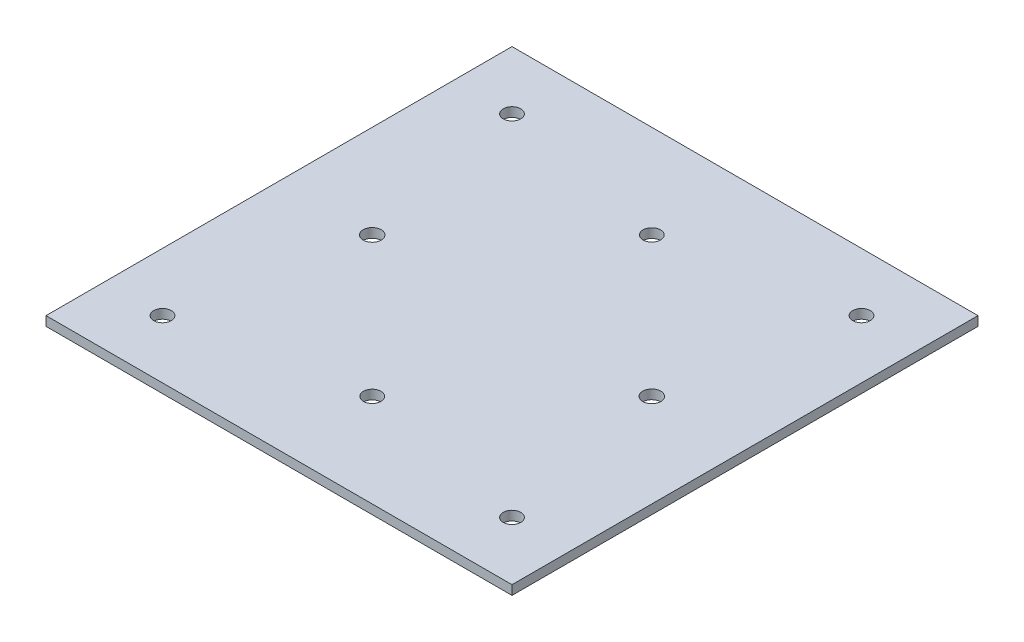
ISO-10303-21;
HEADER;
FILE_DESCRIPTION(('STEP AP214'),'2;1');
FILE_NAME('part.step','',(''),(''),'','','');
FILE_SCHEMA(('AUTOMOTIVE_DESIGN { 1 0 10303 214 1 1 1 1 }'));
ENDSEC;
DATA;
#1=APPLICATION_CONTEXT('core data for automotive mechanical design processes');
#2=APPLICATION_PROTOCOL_DEFINITION('international standard','automotive_design',2000,#1);
#3=PRODUCT_CONTEXT('',#1,'mechanical');
#4=PRODUCT('Part','Part','',(#3));
#5=PRODUCT_RELATED_PRODUCT_CATEGORY('part','',(#4));
#6=PRODUCT_DEFINITION_FORMATION('','',#4);
#7=PRODUCT_DEFINITION_CONTEXT('part definition',#1,'design');
#8=PRODUCT_DEFINITION('design','',#6,#7);
#9=PRODUCT_DEFINITION_SHAPE('','',#8);
#10=(LENGTH_UNIT() NAMED_UNIT(*) SI_UNIT(.MILLI.,.METRE.));
#11=(NAMED_UNIT(*) PLANE_ANGLE_UNIT() SI_UNIT($,.RADIAN.));
#12=(NAMED_UNIT(*) SI_UNIT($,.STERADIAN.) SOLID_ANGLE_UNIT());
#13=UNCERTAINTY_MEASURE_WITH_UNIT(LENGTH_MEASURE(1.E-05),#10,'distance_accuracy_value','');
#14=(GEOMETRIC_REPRESENTATION_CONTEXT(3) GLOBAL_UNCERTAINTY_ASSIGNED_CONTEXT((#13)) GLOBAL_UNIT_ASSIGNED_CONTEXT((#10,
#11,#12)) REPRESENTATION_CONTEXT('',''));
#15=CARTESIAN_POINT('',(0.,0.,0.));
#16=DIRECTION('',(0.,0.,1.));
#17=DIRECTION('',(1.,0.,0.));
#18=AXIS2_PLACEMENT_3D('',#15,#16,#17);
#19=CARTESIAN_POINT('',(0.,1.6,0.));
#20=DIRECTION('',(0.,-1.,0.));
#21=DIRECTION('',(0.,0.,-1.));
#22=AXIS2_PLACEMENT_3D('',#19,#20,#21);
#23=PLANE('',#22);
#24=CARTESIAN_POINT('',(24.,1.6,-48.));
#25=DIRECTION('',(0.,1.,0.));
#26=DIRECTION('',(0.,0.,1.));
#27=AXIS2_PLACEMENT_3D('',#24,#25,#26);
#28=CIRCLE('',#27,1.55);
#29=CARTESIAN_POINT('',(24.,1.6,-46.45));
#30=VERTEX_POINT('',#29);
#31=EDGE_CURVE('E142',#30,#30,#28,.T.);
#32=ORIENTED_EDGE('',*,*,#31,.F.);
#33=EDGE_LOOP('',(#32));
#34=FACE_BOUND('',#33,.T.);
#35=CARTESIAN_POINT('',(18.,1.6,-18.));
#36=DIRECTION('',(0.,1.,0.));
#37=DIRECTION('',(0.,0.,-1.));
#38=AXIS2_PLACEMENT_3D('',#35,#36,#37);
#39=CIRCLE('',#38,1.50499999999999);
#40=CARTESIAN_POINT('',(18.,1.6,-19.505));
#41=VERTEX_POINT('',#40);
#42=EDGE_CURVE('E105',#41,#41,#39,.T.);
#43=ORIENTED_EDGE('',*,*,#42,.F.);
#44=EDGE_LOOP('',(#43));
#45=FACE_BOUND('',#44,.T.);
#46=CARTESIAN_POINT('',(78.,1.6,-18.));
#47=DIRECTION('',(0.,1.,0.));
#48=DIRECTION('',(0.,0.,1.));
#49=AXIS2_PLACEMENT_3D('',#46,#47,#48);
#50=CIRCLE('',#49,1.50499999999999);
#51=CARTESIAN_POINT('',(78.,1.6,-16.495));
#52=VERTEX_POINT('',#51);
#53=EDGE_CURVE('E119',#52,#52,#50,.T.);
#54=ORIENTED_EDGE('',*,*,#53,.F.);
#55=EDGE_LOOP('',(#54));
#56=FACE_BOUND('',#55,.T.);
#57=CARTESIAN_POINT('',(78.,1.6,-78.));
#58=DIRECTION('',(0.,1.,0.));
#59=DIRECTION('',(0.,0.,-1.));
#60=AXIS2_PLACEMENT_3D('',#57,#58,#59);
#61=CIRCLE('',#60,1.50499999999999);
#62=CARTESIAN_POINT('',(78.,1.6,-79.505));
#63=VERTEX_POINT('',#62);
#64=EDGE_CURVE('E113',#63,#63,#61,.T.);
#65=ORIENTED_EDGE('',*,*,#64,.F.);
#66=EDGE_LOOP('',(#65));
#67=FACE_BOUND('',#66,.T.);
#68=CARTESIAN_POINT('',(72.,1.6,-48.));
#69=DIRECTION('',(0.,1.,0.));
#70=DIRECTION('',(0.,0.,-1.));
#71=AXIS2_PLACEMENT_3D('',#68,#69,#70);
#72=CIRCLE('',#71,1.55000000000001);
#73=CARTESIAN_POINT('',(72.,1.6,-49.55));
#74=VERTEX_POINT('',#73);
#75=EDGE_CURVE('E143',#74,#74,#72,.T.);
#76=ORIENTED_EDGE('',*,*,#75,.F.);
#77=EDGE_LOOP('',(#76));
#78=FACE_BOUND('',#77,.T.);
#79=CARTESIAN_POINT('',(48.,1.6,-72.));
#80=DIRECTION('',(0.,1.,0.));
#81=DIRECTION('',(0.,0.,1.));
#82=AXIS2_PLACEMENT_3D('',#79,#80,#81);
#83=CIRCLE('',#82,1.505);
#84=CARTESIAN_POINT('',(48.,1.6,-70.495));
#85=VERTEX_POINT('',#84);
#86=EDGE_CURVE('E130',#85,#85,#83,.T.);
#87=ORIENTED_EDGE('',*,*,#86,.F.);
#88=EDGE_LOOP('',(#87));
#89=FACE_BOUND('',#88,.T.);
#90=CARTESIAN_POINT('',(48.,1.6,-24.));
#91=DIRECTION('',(0.,1.,0.));
#92=DIRECTION('',(0.,0.,-1.));
#93=AXIS2_PLACEMENT_3D('',#90,#91,#92);
#94=CIRCLE('',#93,1.505);
#95=CARTESIAN_POINT('',(48.,1.6,-25.505));
#96=VERTEX_POINT('',#95);
#97=EDGE_CURVE('E131',#96,#96,#94,.T.);
#98=ORIENTED_EDGE('',*,*,#97,.F.);
#99=EDGE_LOOP('',(#98));
#100=FACE_BOUND('',#99,.T.);
#101=CARTESIAN_POINT('',(18.,1.6,-78.));
#102=DIRECTION('',(0.,1.,0.));
#103=DIRECTION('',(0.,0.,1.));
#104=AXIS2_PLACEMENT_3D('',#101,#102,#103);
#105=CIRCLE('',#104,1.50499999999999);
#106=CARTESIAN_POINT('',(18.,1.6,-76.495));
#107=VERTEX_POINT('',#106);
#108=EDGE_CURVE('E112',#107,#107,#105,.T.);
#109=ORIENTED_EDGE('',*,*,#108,.F.);
#110=EDGE_LOOP('',(#109));
#111=FACE_BOUND('',#110,.T.);
#112=DIRECTION('',(0.,0.,1.));
#113=VECTOR('',#112,1.);
#114=CARTESIAN_POINT('',(8.00000000000001,1.6,-88.));
#115=LINE('',#114,#113);
#116=CARTESIAN_POINT('',(8.00000000000001,1.6,-88.));
#117=VERTEX_POINT('',#116);
#118=CARTESIAN_POINT('',(8.00000000000004,1.6,-7.99999999999999));
#119=VERTEX_POINT('',#118);
#120=EDGE_CURVE('E101',#117,#119,#115,.T.);
#121=ORIENTED_EDGE('',*,*,#120,.T.);
#122=DIRECTION('',(1.,0.,0.));
#123=VECTOR('',#122,1.);
#124=CARTESIAN_POINT('',(8.00000000000004,1.6,-7.99999999999999));
#125=LINE('',#124,#123);
#126=CARTESIAN_POINT('',(88.,1.6,-8.));
#127=VERTEX_POINT('',#126);
#128=EDGE_CURVE('E99',#119,#127,#125,.T.);
#129=ORIENTED_EDGE('',*,*,#128,.T.);
#130=DIRECTION('',(0.,0.,-1.));
#131=VECTOR('',#130,1.);
#132=CARTESIAN_POINT('',(88.,1.6,-88.));
#133=LINE('',#132,#131);
#134=CARTESIAN_POINT('',(88.,1.6,-88.));
#135=VERTEX_POINT('',#134);
#136=EDGE_CURVE('E55',#127,#135,#133,.T.);
#137=ORIENTED_EDGE('',*,*,#136,.T.);
#138=DIRECTION('',(-1.,0.,0.));
#139=VECTOR('',#138,1.);
#140=CARTESIAN_POINT('',(8.00000000000001,1.6,-88.));
#141=LINE('',#140,#139);
#142=EDGE_CURVE('E91',#135,#117,#141,.T.);
#143=ORIENTED_EDGE('',*,*,#142,.T.);
#144=EDGE_LOOP('',(#121,#129,#137,#143));
#145=FACE_BOUND('',#144,.T.);
#146=ADVANCED_FACE('F40',(#34,#45,#56,#67,#78,#89,#100,#111,#145),#23,.F.);
#147=CARTESIAN_POINT('',(0.,0.,0.));
#148=DIRECTION('',(0.,-1.,0.));
#149=DIRECTION('',(0.,0.,-1.));
#150=AXIS2_PLACEMENT_3D('',#147,#148,#149);
#151=PLANE('',#150);
#152=CARTESIAN_POINT('',(24.,0.,-48.));
#153=DIRECTION('',(0.,1.,0.));
#154=DIRECTION('',(0.,0.,1.));
#155=AXIS2_PLACEMENT_3D('',#152,#153,#154);
#156=CIRCLE('',#155,1.55);
#157=CARTESIAN_POINT('',(24.,0.,-46.45));
#158=VERTEX_POINT('',#157);
#159=EDGE_CURVE('E151',#158,#158,#156,.T.);
#160=ORIENTED_EDGE('',*,*,#159,.T.);
#161=EDGE_LOOP('',(#160));
#162=FACE_BOUND('',#161,.T.);
#163=CARTESIAN_POINT('',(18.,0.,-18.));
#164=DIRECTION('',(0.,1.,0.));
#165=DIRECTION('',(0.,0.,-1.));
#166=AXIS2_PLACEMENT_3D('',#163,#164,#165);
#167=CIRCLE('',#166,1.50499999999999);
#168=CARTESIAN_POINT('',(18.,0.,-19.505));
#169=VERTEX_POINT('',#168);
#170=EDGE_CURVE('E122',#169,#169,#167,.T.);
#171=ORIENTED_EDGE('',*,*,#170,.T.);
#172=EDGE_LOOP('',(#171));
#173=FACE_BOUND('',#172,.T.);
#174=CARTESIAN_POINT('',(78.,0.,-18.));
#175=DIRECTION('',(0.,1.,0.));
#176=DIRECTION('',(0.,0.,1.));
#177=AXIS2_PLACEMENT_3D('',#174,#175,#176);
#178=CIRCLE('',#177,1.50499999999999);
#179=CARTESIAN_POINT('',(78.,0.,-16.495));
#180=VERTEX_POINT('',#179);
#181=EDGE_CURVE('E116',#180,#180,#178,.T.);
#182=ORIENTED_EDGE('',*,*,#181,.T.);
#183=EDGE_LOOP('',(#182));
#184=FACE_BOUND('',#183,.T.);
#185=CARTESIAN_POINT('',(78.,0.,-78.));
#186=DIRECTION('',(0.,1.,0.));
#187=DIRECTION('',(0.,0.,-1.));
#188=AXIS2_PLACEMENT_3D('',#185,#186,#187);
#189=CIRCLE('',#188,1.50499999999999);
#190=CARTESIAN_POINT('',(78.,0.,-79.505));
#191=VERTEX_POINT('',#190);
#192=EDGE_CURVE('E109',#191,#191,#189,.T.);
#193=ORIENTED_EDGE('',*,*,#192,.T.);
#194=EDGE_LOOP('',(#193));
#195=FACE_BOUND('',#194,.T.);
#196=CARTESIAN_POINT('',(72.,0.,-48.));
#197=DIRECTION('',(0.,1.,0.));
#198=DIRECTION('',(0.,0.,-1.));
#199=AXIS2_PLACEMENT_3D('',#196,#197,#198);
#200=CIRCLE('',#199,1.55000000000001);
#201=CARTESIAN_POINT('',(72.,0.,-49.55));
#202=VERTEX_POINT('',#201);
#203=EDGE_CURVE('E139',#202,#202,#200,.T.);
#204=ORIENTED_EDGE('',*,*,#203,.T.);
#205=EDGE_LOOP('',(#204));
#206=FACE_BOUND('',#205,.T.);
#207=CARTESIAN_POINT('',(48.,0.,-72.));
#208=DIRECTION('',(0.,1.,0.));
#209=DIRECTION('',(0.,0.,1.));
#210=AXIS2_PLACEMENT_3D('',#207,#208,#209);
#211=CIRCLE('',#210,1.505);
#212=CARTESIAN_POINT('',(48.,0.,-70.495));
#213=VERTEX_POINT('',#212);
#214=EDGE_CURVE('E146',#213,#213,#211,.T.);
#215=ORIENTED_EDGE('',*,*,#214,.T.);
#216=EDGE_LOOP('',(#215));
#217=FACE_BOUND('',#216,.T.);
#218=CARTESIAN_POINT('',(48.,0.,-24.));
#219=DIRECTION('',(0.,1.,0.));
#220=DIRECTION('',(0.,0.,-1.));
#221=AXIS2_PLACEMENT_3D('',#218,#219,#220);
#222=CIRCLE('',#221,1.505);
#223=CARTESIAN_POINT('',(48.,0.,-25.505));
#224=VERTEX_POINT('',#223);
#225=EDGE_CURVE('E127',#224,#224,#222,.T.);
#226=ORIENTED_EDGE('',*,*,#225,.T.);
#227=EDGE_LOOP('',(#226));
#228=FACE_BOUND('',#227,.T.);
#229=CARTESIAN_POINT('',(18.,0.,-78.));
#230=DIRECTION('',(0.,1.,0.));
#231=DIRECTION('',(0.,0.,1.));
#232=AXIS2_PLACEMENT_3D('',#229,#230,#231);
#233=CIRCLE('',#232,1.50499999999999);
#234=CARTESIAN_POINT('',(18.,0.,-76.495));
#235=VERTEX_POINT('',#234);
#236=EDGE_CURVE('E134',#235,#235,#233,.T.);
#237=ORIENTED_EDGE('',*,*,#236,.T.);
#238=EDGE_LOOP('',(#237));
#239=FACE_BOUND('',#238,.T.);
#240=DIRECTION('',(-1.,0.,0.));
#241=VECTOR('',#240,1.);
#242=CARTESIAN_POINT('',(0.,0.,-7.99999999999999));
#243=LINE('',#242,#241);
#244=CARTESIAN_POINT('',(88.,0.,-8.));
#245=VERTEX_POINT('',#244);
#246=CARTESIAN_POINT('',(8.00000000000004,0.,-7.99999999999999));
#247=VERTEX_POINT('',#246);
#248=EDGE_CURVE('E154',#245,#247,#243,.T.);
#249=ORIENTED_EDGE('',*,*,#248,.T.);
#250=DIRECTION('',(0.,0.,-1.));
#251=VECTOR('',#250,1.);
#252=CARTESIAN_POINT('',(8.00000000000004,0.,0.));
#253=LINE('',#252,#251);
#254=CARTESIAN_POINT('',(8.00000000000001,0.,-88.));
#255=VERTEX_POINT('',#254);
#256=EDGE_CURVE('E12',#247,#255,#253,.T.);
#257=ORIENTED_EDGE('',*,*,#256,.T.);
#258=DIRECTION('',(1.,0.,0.));
#259=VECTOR('',#258,1.);
#260=CARTESIAN_POINT('',(0.,0.,-88.));
#261=LINE('',#260,#259);
#262=CARTESIAN_POINT('',(88.,0.,-88.));
#263=VERTEX_POINT('',#262);
#264=EDGE_CURVE('E48',#255,#263,#261,.T.);
#265=ORIENTED_EDGE('',*,*,#264,.T.);
#266=DIRECTION('',(0.,0.,1.));
#267=VECTOR('',#266,1.);
#268=CARTESIAN_POINT('',(88.,0.,0.));
#269=LINE('',#268,#267);
#270=EDGE_CURVE('E84',#263,#245,#269,.T.);
#271=ORIENTED_EDGE('',*,*,#270,.T.);
#272=EDGE_LOOP('',(#249,#257,#265,#271));
#273=FACE_BOUND('',#272,.T.);
#274=ADVANCED_FACE('F42',(#162,#173,#184,#195,#206,#217,#228,#239,#273),#151,.T.);
#275=CARTESIAN_POINT('',(24.,0.,-48.));
#276=DIRECTION('',(0.,1.,0.));
#277=DIRECTION('',(0.,0.,1.));
#278=AXIS2_PLACEMENT_3D('',#275,#276,#277);
#279=CYLINDRICAL_SURFACE('',#278,1.55);
#280=ORIENTED_EDGE('',*,*,#159,.F.);
#281=EDGE_LOOP('',(#280));
#282=FACE_BOUND('',#281,.T.);
#283=ORIENTED_EDGE('',*,*,#31,.T.);
#284=EDGE_LOOP('',(#283));
#285=FACE_BOUND('',#284,.T.);
#286=ADVANCED_FACE('F176',(#282,#285),#279,.F.);
#287=CARTESIAN_POINT('',(18.,0.,-18.));
#288=DIRECTION('',(0.,1.,0.));
#289=DIRECTION('',(0.,0.,1.));
#290=AXIS2_PLACEMENT_3D('',#287,#288,#289);
#291=CYLINDRICAL_SURFACE('',#290,1.50499999999999);
#292=ORIENTED_EDGE('',*,*,#170,.F.);
#293=EDGE_LOOP('',(#292));
#294=FACE_BOUND('',#293,.T.);
#295=ORIENTED_EDGE('',*,*,#42,.T.);
#296=EDGE_LOOP('',(#295));
#297=FACE_BOUND('',#296,.T.);
#298=ADVANCED_FACE('F183',(#294,#297),#291,.F.);
#299=CARTESIAN_POINT('',(78.,0.,-18.));
#300=DIRECTION('',(0.,1.,0.));
#301=DIRECTION('',(0.,0.,1.));
#302=AXIS2_PLACEMENT_3D('',#299,#300,#301);
#303=CYLINDRICAL_SURFACE('',#302,1.50499999999999);
#304=ORIENTED_EDGE('',*,*,#181,.F.);
#305=EDGE_LOOP('',(#304));
#306=FACE_BOUND('',#305,.T.);
#307=ORIENTED_EDGE('',*,*,#53,.T.);
#308=EDGE_LOOP('',(#307));
#309=FACE_BOUND('',#308,.T.);
#310=ADVANCED_FACE('F204',(#306,#309),#303,.F.);
#311=CARTESIAN_POINT('',(78.,0.,-78.));
#312=DIRECTION('',(0.,1.,0.));
#313=DIRECTION('',(0.,0.,1.));
#314=AXIS2_PLACEMENT_3D('',#311,#312,#313);
#315=CYLINDRICAL_SURFACE('',#314,1.50499999999999);
#316=ORIENTED_EDGE('',*,*,#192,.F.);
#317=EDGE_LOOP('',(#316));
#318=FACE_BOUND('',#317,.T.);
#319=ORIENTED_EDGE('',*,*,#64,.T.);
#320=EDGE_LOOP('',(#319));
#321=FACE_BOUND('',#320,.T.);
#322=ADVANCED_FACE('F193',(#318,#321),#315,.F.);
#323=CARTESIAN_POINT('',(72.,0.,-48.));
#324=DIRECTION('',(0.,1.,0.));
#325=DIRECTION('',(0.,0.,1.));
#326=AXIS2_PLACEMENT_3D('',#323,#324,#325);
#327=CYLINDRICAL_SURFACE('',#326,1.55000000000001);
#328=ORIENTED_EDGE('',*,*,#203,.F.);
#329=EDGE_LOOP('',(#328));
#330=FACE_BOUND('',#329,.T.);
#331=ORIENTED_EDGE('',*,*,#75,.T.);
#332=EDGE_LOOP('',(#331));
#333=FACE_BOUND('',#332,.T.);
#334=ADVANCED_FACE('F189',(#330,#333),#327,.F.);
#335=CARTESIAN_POINT('',(48.,0.,-72.));
#336=DIRECTION('',(0.,1.,0.));
#337=DIRECTION('',(0.,0.,1.));
#338=AXIS2_PLACEMENT_3D('',#335,#336,#337);
#339=CYLINDRICAL_SURFACE('',#338,1.505);
#340=ORIENTED_EDGE('',*,*,#214,.F.);
#341=EDGE_LOOP('',(#340));
#342=FACE_BOUND('',#341,.T.);
#343=ORIENTED_EDGE('',*,*,#86,.T.);
#344=EDGE_LOOP('',(#343));
#345=FACE_BOUND('',#344,.T.);
#346=ADVANCED_FACE('F185',(#342,#345),#339,.F.);
#347=CARTESIAN_POINT('',(48.,0.,-24.));
#348=DIRECTION('',(0.,1.,0.));
#349=DIRECTION('',(0.,0.,1.));
#350=AXIS2_PLACEMENT_3D('',#347,#348,#349);
#351=CYLINDRICAL_SURFACE('',#350,1.505);
#352=ORIENTED_EDGE('',*,*,#225,.F.);
#353=EDGE_LOOP('',(#352));
#354=FACE_BOUND('',#353,.T.);
#355=ORIENTED_EDGE('',*,*,#97,.T.);
#356=EDGE_LOOP('',(#355));
#357=FACE_BOUND('',#356,.T.);
#358=ADVANCED_FACE('F188',(#354,#357),#351,.F.);
#359=CARTESIAN_POINT('',(18.,0.,-78.));
#360=DIRECTION('',(0.,1.,0.));
#361=DIRECTION('',(0.,0.,1.));
#362=AXIS2_PLACEMENT_3D('',#359,#360,#361);
#363=CYLINDRICAL_SURFACE('',#362,1.50499999999999);
#364=ORIENTED_EDGE('',*,*,#236,.F.);
#365=EDGE_LOOP('',(#364));
#366=FACE_BOUND('',#365,.T.);
#367=ORIENTED_EDGE('',*,*,#108,.T.);
#368=EDGE_LOOP('',(#367));
#369=FACE_BOUND('',#368,.T.);
#370=ADVANCED_FACE('F195',(#366,#369),#363,.F.);
#371=CARTESIAN_POINT('',(8.00000000000001,-8.4,-88.));
#372=DIRECTION('',(-1.,0.,0.));
#373=DIRECTION('',(0.,0.,1.));
#374=AXIS2_PLACEMENT_3D('',#371,#372,#373);
#375=PLANE('',#374);
#376=DIRECTION('',(0.,1.,0.));
#377=VECTOR('',#376,1.);
#378=CARTESIAN_POINT('',(8.00000000000004,-8.4,-7.99999999999999));
#379=LINE('',#378,#377);
#380=EDGE_CURVE('E63',#247,#119,#379,.T.);
#381=ORIENTED_EDGE('',*,*,#380,.T.);
#382=ORIENTED_EDGE('',*,*,#120,.F.);
#383=DIRECTION('',(0.,1.,0.));
#384=VECTOR('',#383,1.);
#385=CARTESIAN_POINT('',(8.00000000000001,-8.4,-88.));
#386=LINE('',#385,#384);
#387=EDGE_CURVE('E87',#255,#117,#386,.T.);
#388=ORIENTED_EDGE('',*,*,#387,.F.);
#389=ORIENTED_EDGE('',*,*,#256,.F.);
#390=EDGE_LOOP('',(#381,#382,#388,#389));
#391=FACE_BOUND('',#390,.T.);
#392=ADVANCED_FACE('F161',(#391),#375,.T.);
#393=CARTESIAN_POINT('',(8.00000000000001,-8.4,-88.));
#394=DIRECTION('',(0.,0.,-1.));
#395=DIRECTION('',(-1.,0.,0.));
#396=AXIS2_PLACEMENT_3D('',#393,#394,#395);
#397=PLANE('',#396);
#398=ORIENTED_EDGE('',*,*,#387,.T.);
#399=ORIENTED_EDGE('',*,*,#142,.F.);
#400=DIRECTION('',(0.,1.,0.));
#401=VECTOR('',#400,1.);
#402=CARTESIAN_POINT('',(88.,-8.4,-88.));
#403=LINE('',#402,#401);
#404=EDGE_CURVE('E80',#263,#135,#403,.T.);
#405=ORIENTED_EDGE('',*,*,#404,.F.);
#406=ORIENTED_EDGE('',*,*,#264,.F.);
#407=EDGE_LOOP('',(#398,#399,#405,#406));
#408=FACE_BOUND('',#407,.T.);
#409=ADVANCED_FACE('F92',(#408),#397,.T.);
#410=CARTESIAN_POINT('',(88.,-8.4,-88.));
#411=DIRECTION('',(1.,0.,0.));
#412=DIRECTION('',(0.,0.,-1.));
#413=AXIS2_PLACEMENT_3D('',#410,#411,#412);
#414=PLANE('',#413);
#415=ORIENTED_EDGE('',*,*,#404,.T.);
#416=ORIENTED_EDGE('',*,*,#136,.F.);
#417=DIRECTION('',(0.,1.,0.));
#418=VECTOR('',#417,1.);
#419=CARTESIAN_POINT('',(88.,-8.4,-8.));
#420=LINE('',#419,#418);
#421=EDGE_CURVE('E88',#245,#127,#420,.T.);
#422=ORIENTED_EDGE('',*,*,#421,.F.);
#423=ORIENTED_EDGE('',*,*,#270,.F.);
#424=EDGE_LOOP('',(#415,#416,#422,#423));
#425=FACE_BOUND('',#424,.T.);
#426=ADVANCED_FACE('F82',(#425),#414,.T.);
#427=CARTESIAN_POINT('',(8.00000000000004,-8.4,-7.99999999999999));
#428=DIRECTION('',(0.,0.,1.));
#429=DIRECTION('',(1.,0.,0.));
#430=AXIS2_PLACEMENT_3D('',#427,#428,#429);
#431=PLANE('',#430);
#432=ORIENTED_EDGE('',*,*,#421,.T.);
#433=ORIENTED_EDGE('',*,*,#128,.F.);
#434=ORIENTED_EDGE('',*,*,#380,.F.);
#435=ORIENTED_EDGE('',*,*,#248,.F.);
#436=EDGE_LOOP('',(#432,#433,#434,#435));
#437=FACE_BOUND('',#436,.T.);
#438=ADVANCED_FACE('F162',(#437),#431,.T.);
#439=CLOSED_SHELL('',(#146,#274,#286,#298,#310,#322,#334,#346,#358,#370,#392,#409,#426,#438));
#440=MANIFOLD_SOLID_BREP('B2',#439);
#441=ADVANCED_BREP_SHAPE_REPRESENTATION('',(#18,#440),#14);
#442=SHAPE_DEFINITION_REPRESENTATION(#9,#441);
ENDSEC;
END-ISO-10303-21;
